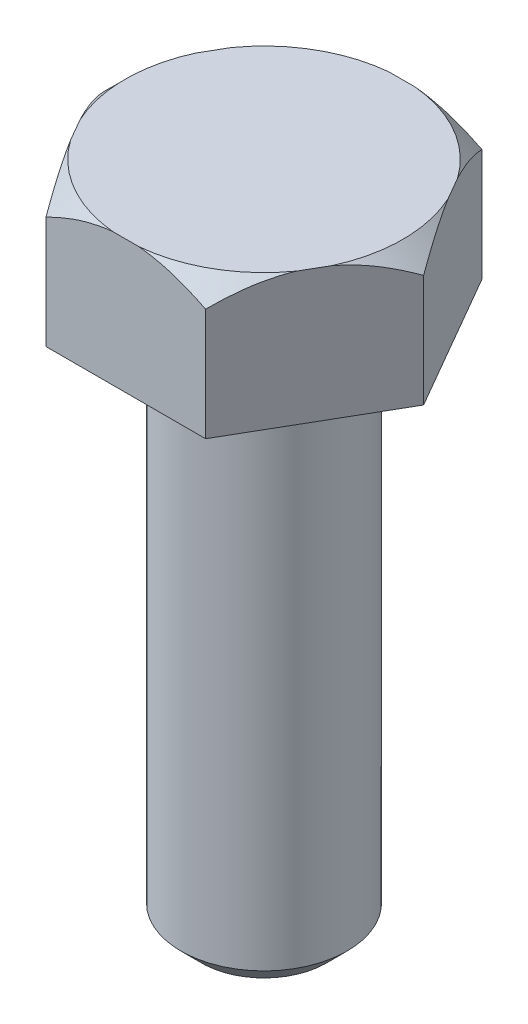
ISO-10303-21;
HEADER;
FILE_DESCRIPTION(('STEP AP214'),'2;1');
FILE_NAME('part.step','',(''),(''),'','','');
FILE_SCHEMA(('AUTOMOTIVE_DESIGN { 1 0 10303 214 1 1 1 1 }'));
ENDSEC;
DATA;
#1=APPLICATION_CONTEXT('core data for automotive mechanical design processes');
#2=APPLICATION_PROTOCOL_DEFINITION('international standard','automotive_design',2000,#1);
#3=PRODUCT_CONTEXT('',#1,'mechanical');
#4=PRODUCT('Part','Part','',(#3));
#5=PRODUCT_RELATED_PRODUCT_CATEGORY('part','',(#4));
#6=PRODUCT_DEFINITION_FORMATION('','',#4);
#7=PRODUCT_DEFINITION_CONTEXT('part definition',#1,'design');
#8=PRODUCT_DEFINITION('design','',#6,#7);
#9=PRODUCT_DEFINITION_SHAPE('','',#8);
#10=(LENGTH_UNIT() NAMED_UNIT(*) SI_UNIT(.MILLI.,.METRE.));
#11=(NAMED_UNIT(*) PLANE_ANGLE_UNIT() SI_UNIT($,.RADIAN.));
#12=(NAMED_UNIT(*) SI_UNIT($,.STERADIAN.) SOLID_ANGLE_UNIT());
#13=UNCERTAINTY_MEASURE_WITH_UNIT(LENGTH_MEASURE(1.E-05),#10,'distance_accuracy_value','');
#14=(GEOMETRIC_REPRESENTATION_CONTEXT(3) GLOBAL_UNCERTAINTY_ASSIGNED_CONTEXT((#13)) GLOBAL_UNIT_ASSIGNED_CONTEXT((#10,
#11,#12)) REPRESENTATION_CONTEXT('',''));
#15=CARTESIAN_POINT('',(0.,0.,0.));
#16=DIRECTION('',(0.,0.,1.));
#17=DIRECTION('',(1.,0.,0.));
#18=AXIS2_PLACEMENT_3D('',#15,#16,#17);
#19=CARTESIAN_POINT('',(-3.048,10.16,0.));
#20=DIRECTION('',(0.,1.,0.));
#21=DIRECTION('',(0.,0.,1.));
#22=AXIS2_PLACEMENT_3D('',#19,#20,#21);
#23=PLANE('',#22);
#24=CARTESIAN_POINT('',(0.,10.16,0.));
#25=DIRECTION('',(0.,-1.,0.));
#26=DIRECTION('',(0.,0.,-1.));
#27=AXIS2_PLACEMENT_3D('',#24,#25,#26);
#28=CIRCLE('',#27,1.5875);
#29=CARTESIAN_POINT('',(0.,10.16,-1.5875));
#30=VERTEX_POINT('',#29);
#31=EDGE_CURVE('E191',#30,#30,#28,.T.);
#32=ORIENTED_EDGE('',*,*,#31,.F.);
#33=EDGE_LOOP('',(#32));
#34=FACE_BOUND('',#33,.T.);
#35=DIRECTION('',(0.5,0.,-0.866025403784439));
#36=VECTOR('',#35,1.);
#37=CARTESIAN_POINT('',(-1.524,10.16,-2.63964543073497));
#38=LINE('',#37,#36);
#39=CARTESIAN_POINT('',(-3.048,10.16,0.));
#40=VERTEX_POINT('',#39);
#41=CARTESIAN_POINT('',(-1.524,10.16,-2.63964543073497));
#42=VERTEX_POINT('',#41);
#43=EDGE_CURVE('E131',#40,#42,#38,.T.);
#44=ORIENTED_EDGE('',*,*,#43,.T.);
#45=DIRECTION('',(1.,0.,0.));
#46=VECTOR('',#45,1.);
#47=CARTESIAN_POINT('',(1.524,10.16,-2.63964543073497));
#48=LINE('',#47,#46);
#49=CARTESIAN_POINT('',(1.524,10.16,-2.63964543073497));
#50=VERTEX_POINT('',#49);
#51=EDGE_CURVE('E122',#42,#50,#48,.T.);
#52=ORIENTED_EDGE('',*,*,#51,.T.);
#53=DIRECTION('',(0.5,0.,0.866025403784439));
#54=VECTOR('',#53,1.);
#55=CARTESIAN_POINT('',(3.048,10.16,0.));
#56=LINE('',#55,#54);
#57=CARTESIAN_POINT('',(3.048,10.16,0.));
#58=VERTEX_POINT('',#57);
#59=EDGE_CURVE('E130',#50,#58,#56,.T.);
#60=ORIENTED_EDGE('',*,*,#59,.T.);
#61=DIRECTION('',(-0.5,0.,0.866025403784439));
#62=VECTOR('',#61,1.);
#63=CARTESIAN_POINT('',(1.524,10.16,2.63964543073497));
#64=LINE('',#63,#62);
#65=CARTESIAN_POINT('',(1.524,10.16,2.63964543073497));
#66=VERTEX_POINT('',#65);
#67=EDGE_CURVE('E408',#58,#66,#64,.T.);
#68=ORIENTED_EDGE('',*,*,#67,.T.);
#69=DIRECTION('',(-1.,0.,0.));
#70=VECTOR('',#69,1.);
#71=CARTESIAN_POINT('',(-1.524,10.16,2.63964543073497));
#72=LINE('',#71,#70);
#73=CARTESIAN_POINT('',(-1.524,10.16,2.63964543073497));
#74=VERTEX_POINT('',#73);
#75=EDGE_CURVE('E406',#66,#74,#72,.T.);
#76=ORIENTED_EDGE('',*,*,#75,.T.);
#77=DIRECTION('',(-0.5,0.,-0.866025403784439));
#78=VECTOR('',#77,1.);
#79=CARTESIAN_POINT('',(-3.048,10.16,0.));
#80=LINE('',#79,#78);
#81=EDGE_CURVE('E144',#74,#40,#80,.T.);
#82=ORIENTED_EDGE('',*,*,#81,.T.);
#83=EDGE_LOOP('',(#44,#52,#60,#68,#76,#82));
#84=FACE_BOUND('',#83,.T.);
#85=ADVANCED_FACE('F34',(#34,#84),#23,.F.);
#86=CARTESIAN_POINT('',(0.,0.,0.));
#87=DIRECTION('',(0.,-1.,0.));
#88=DIRECTION('',(0.,0.,-1.));
#89=AXIS2_PLACEMENT_3D('',#86,#87,#88);
#90=CYLINDRICAL_SURFACE('',#89,1.5875);
#91=CARTESIAN_POINT('',(0.,0.396874999999999,0.));
#92=DIRECTION('',(0.,-1.,0.));
#93=DIRECTION('',(0.,0.,-1.));
#94=AXIS2_PLACEMENT_3D('',#91,#92,#93);
#95=CIRCLE('',#94,1.5875);
#96=CARTESIAN_POINT('',(0.,0.396874999999999,-1.5875));
#97=VERTEX_POINT('',#96);
#98=EDGE_CURVE('E193',#97,#97,#95,.T.);
#99=ORIENTED_EDGE('',*,*,#98,.F.);
#100=EDGE_LOOP('',(#99));
#101=FACE_BOUND('',#100,.T.);
#102=ORIENTED_EDGE('',*,*,#31,.T.);
#103=EDGE_LOOP('',(#102));
#104=FACE_BOUND('',#103,.T.);
#105=ADVANCED_FACE('F181',(#101,#104),#90,.T.);
#106=CARTESIAN_POINT('',(0.,0.396874999999999,0.));
#107=DIRECTION('',(0.,1.,0.));
#108=DIRECTION('',(0.,0.,1.));
#109=AXIS2_PLACEMENT_3D('',#106,#107,#108);
#110=CONICAL_SURFACE('',#109,1.5875,0.78539816339745);
#111=CARTESIAN_POINT('',(0.,0.,0.));
#112=DIRECTION('',(0.,-1.,0.));
#113=DIRECTION('',(0.,0.,-1.));
#114=AXIS2_PLACEMENT_3D('',#111,#112,#113);
#115=CIRCLE('',#114,1.190625);
#116=CARTESIAN_POINT('',(0.,0.,-1.190625));
#117=VERTEX_POINT('',#116);
#118=EDGE_CURVE('E197',#117,#117,#115,.T.);
#119=ORIENTED_EDGE('',*,*,#118,.F.);
#120=EDGE_LOOP('',(#119));
#121=FACE_BOUND('',#120,.T.);
#122=ORIENTED_EDGE('',*,*,#98,.T.);
#123=EDGE_LOOP('',(#122));
#124=FACE_BOUND('',#123,.T.);
#125=ADVANCED_FACE('F177',(#121,#124),#110,.T.);
#126=CARTESIAN_POINT('',(-1.190625,0.,0.));
#127=DIRECTION('',(0.,1.,0.));
#128=DIRECTION('',(0.,0.,1.));
#129=AXIS2_PLACEMENT_3D('',#126,#127,#128);
#130=PLANE('',#129);
#131=ORIENTED_EDGE('',*,*,#118,.T.);
#132=EDGE_LOOP('',(#131));
#133=FACE_BOUND('',#132,.T.);
#134=ADVANCED_FACE('F174',(#133),#130,.F.);
#135=CARTESIAN_POINT('',(-1.524,1.3975327675363,-2.63964543073497));
#136=DIRECTION('',(-0.866025403784439,0.,-0.5));
#137=DIRECTION('',(-0.5,0.,0.866025403784439));
#138=AXIS2_PLACEMENT_3D('',#135,#136,#137);
#139=PLANE('',#138);
#140=CARTESIAN_POINT('',(-4.11288664353432,10.8435993779656,1.84443777090293));
#141=CARTESIAN_POINT('',(-4.07678582740626,10.9021209194026,1.78190932317444));
#142=CARTESIAN_POINT('',(-4.04054164918159,10.9602899269393,1.71913256501072));
#143=CARTESIAN_POINT('',(-3.96771769626619,11.0757945337847,1.59299777855325));
#144=CARTESIAN_POINT('',(-3.93113789170358,11.1331300577135,1.52963969851987));
#145=CARTESIAN_POINT('',(-3.82066132939985,11.3039412367449,1.33828867956426));
#146=CARTESIAN_POINT('',(-3.74619407603881,11.4159494067831,1.20930761324282));
#147=CARTESIAN_POINT('',(-3.59317502716506,11.6374949520919,0.94427084606763));
#148=CARTESIAN_POINT('',(-3.51456722255849,11.7468797101761,0.808118134617601));
#149=CARTESIAN_POINT('',(-3.39455641306745,11.9044288300019,0.600253315121653));
#150=CARTESIAN_POINT('',(-3.35421954813982,11.9558378998242,0.530387815648951));
#151=CARTESIAN_POINT('',(-3.27272248072625,12.0559667510177,0.389230754220786));
#152=CARTESIAN_POINT('',(-3.23156238270255,12.1046868706842,0.317939373199215));
#153=CARTESIAN_POINT('',(-3.14719519820696,12.2000323111787,0.171811123161321));
#154=CARTESIAN_POINT('',(-3.10396275561702,12.2465684687686,0.0969303360602448));
#155=CARTESIAN_POINT('',(-3.01635996860491,12.3352138177515,-0.0548021419293754));
#156=CARTESIAN_POINT('',(-2.97198946278154,12.3773223768515,-0.131654112372982));
#157=CARTESIAN_POINT('',(-2.88225517921881,12.4557269039846,-0.287078450684421));
#158=CARTESIAN_POINT('',(-2.83689805560691,12.4920530198065,-0.365639293265417));
#159=CARTESIAN_POINT('',(-2.74493724949411,12.5577655240635,-0.524920081757766));
#160=CARTESIAN_POINT('',(-2.69833394902363,12.5871540127635,-0.605639365973049));
#161=CARTESIAN_POINT('',(-2.61324102682555,12.6325347284284,-0.753024630584625));
#162=CARTESIAN_POINT('',(-2.57495209164136,12.6500237553908,-0.819343011691345));
#163=CARTESIAN_POINT('',(-2.49779115091639,12.6787834768816,-0.952989681386816));
#164=CARTESIAN_POINT('',(-2.45891923092847,12.6900550748196,-1.02031782179364));
#165=CARTESIAN_POINT('',(-2.38089756061301,12.7058011115166,-1.15545531887141));
#166=CARTESIAN_POINT('',(-2.34174842648433,12.7102875891306,-1.22326360825461));
#167=CARTESIAN_POINT('',(-2.26340495118995,12.712255166541,-1.35895848790599));
#168=CARTESIAN_POINT('',(-2.22421060958001,12.7097361969007,-1.42684507894362));
#169=CARTESIAN_POINT('',(-2.1461896803201,12.6978483985597,-1.56198129247552));
#170=CARTESIAN_POINT('',(-2.10736239969831,12.6884974706097,-1.62923211523219));
#171=CARTESIAN_POINT('',(-2.03022149857727,12.6634458657462,-1.76284407531549));
#172=CARTESIAN_POINT('',(-1.99190800201554,12.6477436842384,-1.82920499797601));
#173=CARTESIAN_POINT('',(-1.91586591130841,12.6106384716489,-1.96091376259452));
#174=CARTESIAN_POINT('',(-1.87813938118311,12.5892187242104,-2.02625802956483));
#175=CARTESIAN_POINT('',(-1.80347838700056,12.5414934204444,-2.15557466483259));
#176=CARTESIAN_POINT('',(-1.76654388607405,12.5151880920958,-2.21954709698951));
#177=CARTESIAN_POINT('',(-1.68054671166346,12.4484188088564,-2.36849857237602));
#178=CARTESIAN_POINT('',(-1.63181840695243,12.4062389424071,-2.45289847190222));
#179=CARTESIAN_POINT('',(-1.53573732999577,12.3159803932736,-2.61931577883709));
#180=CARTESIAN_POINT('',(-1.48838530073285,12.2678985949876,-2.70133189936196));
#181=CARTESIAN_POINT('',(-1.39482537931209,12.1670593703652,-2.86338243681487));
#182=CARTESIAN_POINT('',(-1.34862006534442,12.1142924483695,-2.94341238818654));
#183=CARTESIAN_POINT('',(-1.25729466551731,12.0051863160205,-3.10159262070863));
#184=CARTESIAN_POINT('',(-1.21217439101574,11.9488477329114,-3.17974322859681));
#185=CARTESIAN_POINT('',(-1.12264370951622,11.8330812268348,-3.33481491779025));
#186=CARTESIAN_POINT('',(-1.07823755123089,11.7736402198207,-3.41172864010938));
#187=CARTESIAN_POINT('',(-0.990207339851307,11.652479989206,-3.56420143881985));
#188=CARTESIAN_POINT('',(-0.94658335243382,11.5907605756123,-3.63976040145569));
#189=CARTESIAN_POINT('',(-0.816795966696674,11.4030087920242,-3.86455874773396));
#190=CARTESIAN_POINT('',(-0.731617550326509,11.2742511881687,-4.01209209259535));
#191=CARTESIAN_POINT('',(-0.615697802164191,11.0936824781044,-4.21287098601307));
#192=CARTESIAN_POINT('',(-0.58413126456951,11.043954908037,-4.26754583294609));
#193=CARTESIAN_POINT('',(-0.521379413626723,10.9441052314947,-4.37623522704799));
#194=CARTESIAN_POINT('',(-0.490193037172694,10.8939857986208,-4.43025161557033));
#195=CARTESIAN_POINT('',(-0.459113356465683,10.8435993779656,-4.48408320163789));
#196=B_SPLINE_CURVE_WITH_KNOTS('',3,(#140,#141,#142,#143,#144,#145,#146,#147,#148,#149,#150,
#151,#152,#153,#154,#155,#156,#157,#158,#159,#160,#161,#162,#163,#164,#165,#166,#167,#168,#169,
#170,#171,#172,#173,#174,#175,#176,#177,#178,#179,#180,#181,#182,#183,#184,#185,#186,#187,#188,
#189,#190,#191,#192,#193,#194,#195),.UNSPECIFIED.,.F.,.F.,(4,2,2,2,2,2,2,2,2,2,2,2,2,2,2,2,2,2,
2,2,2,2,2,2,2,2,2,4),(0.,0.27881946553275,0.557663992439258,1.11664345937222,1.69099253991238,
1.97793713434816,2.26484554577308,2.55932247188747,2.85384139446958,3.14677059194029,
3.43961099533733,3.67503579126983,3.91042637031573,4.14539880327292,4.3803735652388,
4.61473485617055,4.84915169918358,5.08426155571407,5.31936044392315,5.63767189464671,
5.95615210903306,6.27529322345623,6.59437844571967,6.91493955731194,7.2355274606777,
7.87598755404172,8.1170834857588,8.35712587637016),.UNSPECIFIED.);
#197=CARTESIAN_POINT('',(-3.048,12.303125,0.));
#198=VERTEX_POINT('',#197);
#199=CARTESIAN_POINT('',(-2.40922313665156,12.7,-1.10639398201899));
#200=VERTEX_POINT('',#199);
#201=EDGE_CURVE('E202',#198,#200,#196,.T.);
#202=ORIENTED_EDGE('',*,*,#201,.T.);
#203=DIRECTION('',(-0.5,0.,0.866025403784439));
#204=VECTOR('',#203,1.);
#205=CARTESIAN_POINT('',(-1.524,12.7,-2.63964543073497));
#206=LINE('',#205,#204);
#207=CARTESIAN_POINT('',(-2.16277686334844,12.7,-1.53325144871598));
#208=VERTEX_POINT('',#207);
#209=EDGE_CURVE('E253',#208,#200,#206,.T.);
#210=ORIENTED_EDGE('',*,*,#209,.F.);
#211=CARTESIAN_POINT('',(-1.524,12.303125,-2.63964543073497));
#212=VERTEX_POINT('',#211);
#213=EDGE_CURVE('E138',#208,#212,#196,.T.);
#214=ORIENTED_EDGE('',*,*,#213,.T.);
#215=DIRECTION('',(0.,1.,0.));
#216=VECTOR('',#215,1.);
#217=CARTESIAN_POINT('',(-1.524,1.3975327675363,-2.63964543073497));
#218=LINE('',#217,#216);
#219=EDGE_CURVE('E125',#42,#212,#218,.T.);
#220=ORIENTED_EDGE('',*,*,#219,.F.);
#221=ORIENTED_EDGE('',*,*,#43,.F.);
#222=DIRECTION('',(0.,1.,0.));
#223=VECTOR('',#222,1.);
#224=CARTESIAN_POINT('',(-3.048,1.3975327675363,0.));
#225=LINE('',#224,#223);
#226=EDGE_CURVE('E139',#40,#198,#225,.T.);
#227=ORIENTED_EDGE('',*,*,#226,.T.);
#228=EDGE_LOOP('',(#202,#210,#214,#220,#221,#227));
#229=FACE_BOUND('',#228,.T.);
#230=ADVANCED_FACE('F134',(#229),#139,.T.);
#231=CARTESIAN_POINT('',(-3.048,1.3975327675363,0.));
#232=DIRECTION('',(-0.866025403784439,0.,0.5));
#233=DIRECTION('',(0.5,0.,0.866025403784439));
#234=AXIS2_PLACEMENT_3D('',#231,#232,#233);
#235=PLANE('',#234);
#236=CARTESIAN_POINT('',(-0.459113356465683,10.8435993779656,4.4840832016379));
#237=CARTESIAN_POINT('',(-0.495214172593737,10.9021209194026,4.4215547539094));
#238=CARTESIAN_POINT('',(-0.531458350818409,10.9602899269393,4.35877799574569));
#239=CARTESIAN_POINT('',(-0.604282303733805,11.0757945337847,4.23264320928822));
#240=CARTESIAN_POINT('',(-0.640862108296419,11.1331300577135,4.16928512925484));
#241=CARTESIAN_POINT('',(-0.751338670600148,11.3039412367449,3.97793411029923));
#242=CARTESIAN_POINT('',(-0.825805923961193,11.4159494067831,3.84895304397779));
#243=CARTESIAN_POINT('',(-0.978824972834937,11.6374949520919,3.5839162768026));
#244=CARTESIAN_POINT('',(-1.05743277744151,11.7468797101761,3.44776356535257));
#245=CARTESIAN_POINT('',(-1.17744358693255,11.9044288300019,3.23989874585663));
#246=CARTESIAN_POINT('',(-1.21778045186018,11.9558378998242,3.17003324638392));
#247=CARTESIAN_POINT('',(-1.29927751927375,12.0559667510177,3.02887618495576));
#248=CARTESIAN_POINT('',(-1.34043761729745,12.1046868706842,2.95758480393419));
#249=CARTESIAN_POINT('',(-1.42480480179304,12.2000323111787,2.81145655389629));
#250=CARTESIAN_POINT('',(-1.46803724438298,12.2465684687686,2.73657576679522));
#251=CARTESIAN_POINT('',(-1.55564003139509,12.3352138177515,2.5848432888056));
#252=CARTESIAN_POINT('',(-1.60001053721846,12.3773223768515,2.50799131836199));
#253=CARTESIAN_POINT('',(-1.68974482078119,12.4557269039846,2.35256698005055));
#254=CARTESIAN_POINT('',(-1.73510194439309,12.4920530198065,2.27400613746955));
#255=CARTESIAN_POINT('',(-1.82706275050589,12.5577655240635,2.11472534897721));
#256=CARTESIAN_POINT('',(-1.87366605097637,12.5871540127635,2.03400606476192));
#257=CARTESIAN_POINT('',(-1.95875897317445,12.6325347284284,1.88662080015035));
#258=CARTESIAN_POINT('',(-1.99704790835864,12.6500237553908,1.82030241904363));
#259=CARTESIAN_POINT('',(-2.07420884908361,12.6787834768816,1.68665574934816));
#260=CARTESIAN_POINT('',(-2.11308076907153,12.6900550748196,1.61932760894133));
#261=CARTESIAN_POINT('',(-2.19110243938699,12.7058011115166,1.48419011186357));
#262=CARTESIAN_POINT('',(-2.23025157351567,12.7102875891306,1.41638182248036));
#263=CARTESIAN_POINT('',(-2.30859504881005,12.712255166541,1.28068694282898));
#264=CARTESIAN_POINT('',(-2.34778939041999,12.7097361969007,1.21280035179135));
#265=CARTESIAN_POINT('',(-2.4258103196799,12.6978483985597,1.07766413825945));
#266=CARTESIAN_POINT('',(-2.46463760030169,12.6884974706097,1.01041331550278));
#267=CARTESIAN_POINT('',(-2.54177850142273,12.6634458657462,0.876801355419483));
#268=CARTESIAN_POINT('',(-2.58009199798446,12.6477436842384,0.810440432758961));
#269=CARTESIAN_POINT('',(-2.65613408869159,12.6106384716489,0.678731668140453));
#270=CARTESIAN_POINT('',(-2.69386061881689,12.5892187242104,0.613387401170142));
#271=CARTESIAN_POINT('',(-2.76852161299943,12.5414934204444,0.484070765902376));
#272=CARTESIAN_POINT('',(-2.80545611392595,12.5151880920958,0.420098333745457));
#273=CARTESIAN_POINT('',(-2.89145328833654,12.4484188088564,0.271146858358955));
#274=CARTESIAN_POINT('',(-2.94018159304757,12.4062389424071,0.186746958832748));
#275=CARTESIAN_POINT('',(-3.03626267000423,12.3159803932736,0.0203296518978808));
#276=CARTESIAN_POINT('',(-3.08361469926715,12.2678985949876,-0.0616864686269907));
#277=CARTESIAN_POINT('',(-3.17717462068791,12.1670593703652,-0.223737006079898));
#278=CARTESIAN_POINT('',(-3.22337993465557,12.1142924483695,-0.303766957451566));
#279=CARTESIAN_POINT('',(-3.31470533448268,12.0051863160205,-0.461947189973658));
#280=CARTESIAN_POINT('',(-3.35982560898425,11.9488477329114,-0.540097797861834));
#281=CARTESIAN_POINT('',(-3.44935629048378,11.8330812268348,-0.695169487055275));
#282=CARTESIAN_POINT('',(-3.4937624487691,11.7736402198207,-0.772083209374405));
#283=CARTESIAN_POINT('',(-3.58179266014869,11.652479989206,-0.924556008084875));
#284=CARTESIAN_POINT('',(-3.62541664756617,11.5907605756123,-1.00011497072071));
#285=CARTESIAN_POINT('',(-3.75520403330332,11.4030087920242,-1.22491331699899));
#286=CARTESIAN_POINT('',(-3.84038244967348,11.2742511881687,-1.37244666186037));
#287=CARTESIAN_POINT('',(-3.9563021978358,11.0936824781044,-1.57322555527809));
#288=CARTESIAN_POINT('',(-3.98786873543049,11.043954908037,-1.62790040221111));
#289=CARTESIAN_POINT('',(-4.05062058637328,10.9441052314947,-1.73658979631302));
#290=CARTESIAN_POINT('',(-4.08180696282731,10.8939857986208,-1.79060618483537));
#291=CARTESIAN_POINT('',(-4.11288664353432,10.8435993779656,-1.84443777090293));
#292=B_SPLINE_CURVE_WITH_KNOTS('',3,(#236,#237,#238,#239,#240,#241,#242,#243,#244,#245,#246,
#247,#248,#249,#250,#251,#252,#253,#254,#255,#256,#257,#258,#259,#260,#261,#262,#263,#264,#265,
#266,#267,#268,#269,#270,#271,#272,#273,#274,#275,#276,#277,#278,#279,#280,#281,#282,#283,#284,
#285,#286,#287,#288,#289,#290,#291),.UNSPECIFIED.,.F.,.F.,(4,2,2,2,2,2,2,2,2,2,2,2,2,2,2,2,2,2,
2,2,2,2,2,2,2,2,2,4),(0.,0.27881946553275,0.557663992439256,1.11664345937222,1.69099253991237,
1.97793713434816,2.26484554577308,2.55932247188747,2.85384139446958,3.14677059194028,
3.43961099533733,3.67503579126983,3.91042637031573,4.14539880327292,4.3803735652388,
4.61473485617055,4.84915169918358,5.08426155571406,5.31936044392315,5.63767189464671,
5.95615210903305,6.27529322345622,6.59437844571966,6.91493955731193,7.23552746067769,
7.8759875540417,8.1170834857588,8.35712587637016),.UNSPECIFIED.);
#293=CARTESIAN_POINT('',(-1.524,12.303125,2.63964543073497));
#294=VERTEX_POINT('',#293);
#295=CARTESIAN_POINT('',(-2.16277686334844,12.7,1.53325144871598));
#296=VERTEX_POINT('',#295);
#297=EDGE_CURVE('E207',#294,#296,#292,.T.);
#298=ORIENTED_EDGE('',*,*,#297,.T.);
#299=DIRECTION('',(0.5,0.,0.866025403784439));
#300=VECTOR('',#299,1.);
#301=CARTESIAN_POINT('',(-3.048,12.7,0.));
#302=LINE('',#301,#300);
#303=CARTESIAN_POINT('',(-2.40922313665156,12.7,1.10639398201898));
#304=VERTEX_POINT('',#303);
#305=EDGE_CURVE('E282',#304,#296,#302,.T.);
#306=ORIENTED_EDGE('',*,*,#305,.F.);
#307=EDGE_CURVE('E208',#304,#198,#292,.T.);
#308=ORIENTED_EDGE('',*,*,#307,.T.);
#309=ORIENTED_EDGE('',*,*,#226,.F.);
#310=ORIENTED_EDGE('',*,*,#81,.F.);
#311=DIRECTION('',(0.,1.,0.));
#312=VECTOR('',#311,1.);
#313=CARTESIAN_POINT('',(-1.524,1.3975327675363,2.63964543073497));
#314=LINE('',#313,#312);
#315=EDGE_CURVE('E289',#74,#294,#314,.T.);
#316=ORIENTED_EDGE('',*,*,#315,.T.);
#317=EDGE_LOOP('',(#298,#306,#308,#309,#310,#316));
#318=FACE_BOUND('',#317,.T.);
#319=ADVANCED_FACE('F219',(#318),#235,.T.);
#320=CARTESIAN_POINT('',(-1.524,1.3975327675363,2.63964543073497));
#321=DIRECTION('',(0.,0.,1.));
#322=DIRECTION('',(1.,0.,0.));
#323=AXIS2_PLACEMENT_3D('',#320,#321,#322);
#324=PLANE('',#323);
#325=CARTESIAN_POINT('',(3.36843777090293,11.0716272471737,2.63964543073497));
#326=CARTESIAN_POINT('',(3.29300533086438,11.1309904142921,2.63964543073497));
#327=CARTESIAN_POINT('',(3.21721116588583,11.1898998144176,2.63964543073497));
#328=CARTESIAN_POINT('',(3.06475975547845,11.3066161754144,2.63964543073497));
#329=CARTESIAN_POINT('',(2.98810237080206,11.3644229542481,2.63964543073497));
#330=CARTESIAN_POINT('',(2.83342142775568,11.4790070758794,2.63964543073497));
#331=CARTESIAN_POINT('',(2.75539293681663,11.5357777774649,2.63964543073497));
#332=CARTESIAN_POINT('',(2.59819285687469,11.6477095018479,2.63964543073497));
#333=CARTESIAN_POINT('',(2.51902132254628,11.7028706012577,2.63964543073497));
#334=CARTESIAN_POINT('',(2.35540072261572,11.8139153435705,2.63964543073497));
#335=CARTESIAN_POINT('',(2.27088420410221,11.8696999741638,2.63964543073497));
#336=CARTESIAN_POINT('',(2.10014323865491,11.978588185785,2.63964543073497));
#337=CARTESIAN_POINT('',(2.0139189340055,12.0316919888691,2.63964543073497));
#338=CARTESIAN_POINT('',(1.83964075821573,12.1344403340379,2.63964543073497));
#339=CARTESIAN_POINT('',(1.75159063932343,12.1840912038149,2.63964543073497));
#340=CARTESIAN_POINT('',(1.57323353816042,12.2791390165827,2.63964543073497));
#341=CARTESIAN_POINT('',(1.48292717325064,12.3245371074288,2.63964543073497));
#342=CARTESIAN_POINT('',(1.30923491291055,12.4055265018222,2.63964543073497));
#343=CARTESIAN_POINT('',(1.22609731337137,12.4416463913053,2.63964543073497));
#344=CARTESIAN_POINT('',(1.05765772606736,12.5085214573747,2.63964543073497));
#345=CARTESIAN_POINT('',(0.972355531859266,12.5392761200453,2.63964543073497));
#346=CARTESIAN_POINT('',(0.800615928832101,12.5939220040834,2.63964543073497));
#347=CARTESIAN_POINT('',(0.714202325615142,12.6178870271769,2.63964543073497));
#348=CARTESIAN_POINT('',(0.53962783796491,12.6582223488823,2.63964543073497));
#349=CARTESIAN_POINT('',(0.451467669424469,12.6745956947032,2.63964543073497));
#350=CARTESIAN_POINT('',(0.272286007984842,12.6989838300076,2.63964543073497));
#351=CARTESIAN_POINT('',(0.181241872709602,12.7068358665952,2.63964543073497));
#352=CARTESIAN_POINT('',(-0.00116784871263757,12.713053046394,2.63964543073497));
#353=CARTESIAN_POINT('',(-0.0925334051359861,12.7114190449236,2.63964543073497));
#354=CARTESIAN_POINT('',(-0.2748747122584,12.6987708057578,2.63964543073497));
#355=CARTESIAN_POINT('',(-0.365848480939838,12.6877285389543,2.63964543073497));
#356=CARTESIAN_POINT('',(-0.546317141902598,12.6570072878376,2.63964543073497));
#357=CARTESIAN_POINT('',(-0.635811630573998,12.6373259855137,2.63964543073497));
#358=CARTESIAN_POINT('',(-0.839929534758161,12.5833150058955,2.63964543073497));
#359=CARTESIAN_POINT('',(-0.953848430684294,12.5463445751224,2.63964543073497));
#360=CARTESIAN_POINT('',(-1.17793818323342,12.4624507503527,2.63964543073497));
#361=CARTESIAN_POINT('',(-1.28810675879306,12.415521420261,2.63964543073497));
#362=CARTESIAN_POINT('',(-1.50567750976445,12.3137777141947,2.63964543073497));
#363=CARTESIAN_POINT('',(-1.61305346512851,12.25890802436,2.63964543073497));
#364=CARTESIAN_POINT('',(-1.82462164483966,12.1434592657673,2.63964543073497));
#365=CARTESIAN_POINT('',(-1.92881459959967,12.082881520086,2.63964543073497));
#366=CARTESIAN_POINT('',(-2.14968617442244,11.9481665910634,2.63964543073497));
#367=CARTESIAN_POINT('',(-2.26594518996787,11.8733460140711,2.63964543073497));
#368=CARTESIAN_POINT('',(-2.4956556650067,11.7194908815111,2.63964543073497));
#369=CARTESIAN_POINT('',(-2.60910648475559,11.6404553784307,2.63964543073497));
#370=CARTESIAN_POINT('',(-2.83121308766027,11.4810303561209,2.63964543073497));
#371=CARTESIAN_POINT('',(-2.93991935744845,11.4007107742223,2.63964543073497));
#372=CARTESIAN_POINT('',(-3.15546241434351,11.2377565653697,2.63964543073497));
#373=CARTESIAN_POINT('',(-3.26230049829602,11.1551236570664,2.63964543073497));
#374=CARTESIAN_POINT('',(-3.36843777090293,11.0716272471737,2.63964543073497));
#375=B_SPLINE_CURVE_WITH_KNOTS('',3,(#325,#326,#327,#328,#329,#330,#331,#332,#333,#334,#335,
#336,#337,#338,#339,#340,#341,#342,#343,#344,#345,#346,#347,#348,#349,#350,#351,#352,#353,#354,
#355,#356,#357,#358,#359,#360,#361,#362,#363,#364,#365,#366,#367,#368,#369,#370,#371,#372,#373,
#374),.UNSPECIFIED.,.F.,.F.,(4,2,2,2,2,2,2,2,2,2,2,2,2,2,2,2,2,2,2,2,2,2,2,2,4),(0.,
0.287973001472166,0.575993141515308,0.865462127525053,1.15491731311935,1.45867727901225,
1.76241204269347,2.06557466941309,2.3686552331896,2.64043968682375,2.91225015942944,
3.1809815977582,3.4496050769024,3.72327344025735,3.99691712841025,4.27137891803137,
4.54591439581094,4.90458781329842,5.26347562496305,5.62499597601811,5.98643273504015,
6.40107016663567,6.81580120463352,7.22124646087129,7.62639809863121),.UNSPECIFIED.);
#376=CARTESIAN_POINT('',(1.524,12.303125,2.63964543073497));
#377=VERTEX_POINT('',#376);
#378=CARTESIAN_POINT('',(0.246446273303119,12.7,2.63964543073497));
#379=VERTEX_POINT('',#378);
#380=EDGE_CURVE('E213',#377,#379,#375,.T.);
#381=ORIENTED_EDGE('',*,*,#380,.T.);
#382=DIRECTION('',(1.,0.,0.));
#383=VECTOR('',#382,1.);
#384=CARTESIAN_POINT('',(-1.524,12.7,2.63964543073497));
#385=LINE('',#384,#383);
#386=CARTESIAN_POINT('',(-0.246446273303118,12.7,2.63964543073497));
#387=VERTEX_POINT('',#386);
#388=EDGE_CURVE('E279',#387,#379,#385,.T.);
#389=ORIENTED_EDGE('',*,*,#388,.F.);
#390=EDGE_CURVE('E214',#387,#294,#375,.T.);
#391=ORIENTED_EDGE('',*,*,#390,.T.);
#392=ORIENTED_EDGE('',*,*,#315,.F.);
#393=ORIENTED_EDGE('',*,*,#75,.F.);
#394=DIRECTION('',(0.,1.,0.));
#395=VECTOR('',#394,1.);
#396=CARTESIAN_POINT('',(1.524,1.3975327675363,2.63964543073497));
#397=LINE('',#396,#395);
#398=EDGE_CURVE('E287',#66,#377,#397,.T.);
#399=ORIENTED_EDGE('',*,*,#398,.T.);
#400=EDGE_LOOP('',(#381,#389,#391,#392,#393,#399));
#401=FACE_BOUND('',#400,.T.);
#402=ADVANCED_FACE('F222',(#401),#324,.T.);
#403=CARTESIAN_POINT('',(1.524,1.3975327675363,2.63964543073497));
#404=DIRECTION('',(0.866025403784439,0.,0.5));
#405=DIRECTION('',(0.5,0.,-0.866025403784439));
#406=AXIS2_PLACEMENT_3D('',#403,#404,#405);
#407=PLANE('',#406);
#408=CARTESIAN_POINT('',(4.11288664353432,10.8435993779656,-1.84443777090293));
#409=CARTESIAN_POINT('',(4.07678582740626,10.9021209194026,-1.78190932317444));
#410=CARTESIAN_POINT('',(4.04054164918159,10.9602899269393,-1.71913256501072));
#411=CARTESIAN_POINT('',(3.9677176962662,11.0757945337847,-1.59299777855325));
#412=CARTESIAN_POINT('',(3.93113789170358,11.1331300577135,-1.52963969851986));
#413=CARTESIAN_POINT('',(3.82066132939985,11.3039412367449,-1.33828867956425));
#414=CARTESIAN_POINT('',(3.74619407603881,11.4159494067831,-1.20930761324282));
#415=CARTESIAN_POINT('',(3.59317502716506,11.6374949520919,-0.944270846067629));
#416=CARTESIAN_POINT('',(3.51456722255849,11.7468797101761,-0.8081181346176));
#417=CARTESIAN_POINT('',(3.39455641306745,11.9044288300019,-0.600253315121653));
#418=CARTESIAN_POINT('',(3.35421954813982,11.9558378998242,-0.530387815648951));
#419=CARTESIAN_POINT('',(3.27272248072625,12.0559667510177,-0.389230754220786));
#420=CARTESIAN_POINT('',(3.23156238270255,12.1046868706842,-0.317939373199214));
#421=CARTESIAN_POINT('',(3.14719519820696,12.2000323111787,-0.171811123161321));
#422=CARTESIAN_POINT('',(3.10396275561702,12.2465684687686,-0.096930336060245));
#423=CARTESIAN_POINT('',(3.01635996860491,12.3352138177515,0.0548021419293748));
#424=CARTESIAN_POINT('',(2.97198946278154,12.3773223768515,0.131654112372982));
#425=CARTESIAN_POINT('',(2.88225517921881,12.4557269039846,0.287078450684421));
#426=CARTESIAN_POINT('',(2.83689805560691,12.4920530198065,0.365639293265418));
#427=CARTESIAN_POINT('',(2.74493724949411,12.5577655240635,0.524920081757766));
#428=CARTESIAN_POINT('',(2.69833394902363,12.5871540127635,0.60563936597305));
#429=CARTESIAN_POINT('',(2.61324102682555,12.6325347284284,0.753024630584626));
#430=CARTESIAN_POINT('',(2.57495209164136,12.6500237553908,0.819343011691347));
#431=CARTESIAN_POINT('',(2.49779115091639,12.6787834768816,0.952989681386818));
#432=CARTESIAN_POINT('',(2.45891923092847,12.6900550748196,1.02031782179364));
#433=CARTESIAN_POINT('',(2.38089756061301,12.7058011115166,1.15545531887141));
#434=CARTESIAN_POINT('',(2.34174842648433,12.7102875891306,1.22326360825461));
#435=CARTESIAN_POINT('',(2.26340495118995,12.712255166541,1.35895848790599));
#436=CARTESIAN_POINT('',(2.22421060958001,12.7097361969007,1.42684507894362));
#437=CARTESIAN_POINT('',(2.1461896803201,12.6978483985597,1.56198129247552));
#438=CARTESIAN_POINT('',(2.10736239969831,12.6884974706097,1.62923211523219));
#439=CARTESIAN_POINT('',(2.03022149857727,12.6634458657462,1.76284407531549));
#440=CARTESIAN_POINT('',(1.99190800201554,12.6477436842384,1.82920499797601));
#441=CARTESIAN_POINT('',(1.91586591130841,12.6106384716489,1.96091376259452));
#442=CARTESIAN_POINT('',(1.8781393811831,12.5892187242104,2.02625802956483));
#443=CARTESIAN_POINT('',(1.80347838700056,12.5414934204444,2.1555746648326));
#444=CARTESIAN_POINT('',(1.76654388607405,12.5151880920958,2.21954709698952));
#445=CARTESIAN_POINT('',(1.68054671166346,12.4484188088564,2.36849857237602));
#446=CARTESIAN_POINT('',(1.63181840695243,12.4062389424071,2.45289847190223));
#447=CARTESIAN_POINT('',(1.53573732999577,12.3159803932736,2.61931577883709));
#448=CARTESIAN_POINT('',(1.48838530073285,12.2678985949876,2.70133189936197));
#449=CARTESIAN_POINT('',(1.39482537931209,12.1670593703652,2.86338243681487));
#450=CARTESIAN_POINT('',(1.34862006534442,12.1142924483695,2.94341238818654));
#451=CARTESIAN_POINT('',(1.25729466551731,12.0051863160205,3.10159262070863));
#452=CARTESIAN_POINT('',(1.21217439101574,11.9488477329114,3.17974322859681));
#453=CARTESIAN_POINT('',(1.12264370951622,11.8330812268348,3.33481491779025));
#454=CARTESIAN_POINT('',(1.07823755123089,11.7736402198207,3.41172864010938));
#455=CARTESIAN_POINT('',(0.990207339851306,11.652479989206,3.56420143881985));
#456=CARTESIAN_POINT('',(0.946583352433818,11.5907605756123,3.63976040145569));
#457=CARTESIAN_POINT('',(0.816795966696671,11.4030087920242,3.86455874773397));
#458=CARTESIAN_POINT('',(0.731617550326507,11.2742511881687,4.01209209259535));
#459=CARTESIAN_POINT('',(0.61569780216419,11.0936824781044,4.21287098601307));
#460=CARTESIAN_POINT('',(0.584131264569508,11.043954908037,4.26754583294609));
#461=CARTESIAN_POINT('',(0.521379413626721,10.9441052314947,4.37623522704799));
#462=CARTESIAN_POINT('',(0.490193037172693,10.8939857986208,4.43025161557033));
#463=CARTESIAN_POINT('',(0.459113356465682,10.8435993779656,4.4840832016379));
#464=B_SPLINE_CURVE_WITH_KNOTS('',3,(#408,#409,#410,#411,#412,#413,#414,#415,#416,#417,#418,
#419,#420,#421,#422,#423,#424,#425,#426,#427,#428,#429,#430,#431,#432,#433,#434,#435,#436,#437,
#438,#439,#440,#441,#442,#443,#444,#445,#446,#447,#448,#449,#450,#451,#452,#453,#454,#455,#456,
#457,#458,#459,#460,#461,#462,#463),.UNSPECIFIED.,.F.,.F.,(4,2,2,2,2,2,2,2,2,2,2,2,2,2,2,2,2,2,
2,2,2,2,2,2,2,2,2,4),(0.,0.27881946553275,0.557663992439258,1.11664345937222,1.69099253991238,
1.97793713434816,2.26484554577308,2.55932247188747,2.85384139446958,3.14677059194029,
3.43961099533734,3.67503579126983,3.91042637031574,4.14539880327292,4.3803735652388,
4.61473485617055,4.84915169918359,5.08426155571407,5.31936044392316,5.63767189464672,
5.95615210903306,6.27529322345623,6.59437844571967,6.91493955731195,7.23552746067771,
7.87598755404172,8.1170834857588,8.35712587637016),.UNSPECIFIED.);
#465=CARTESIAN_POINT('',(3.048,12.303125,0.));
#466=VERTEX_POINT('',#465);
#467=CARTESIAN_POINT('',(2.40922313665155,12.7,1.10639398201899));
#468=VERTEX_POINT('',#467);
#469=EDGE_CURVE('E237',#466,#468,#464,.T.);
#470=ORIENTED_EDGE('',*,*,#469,.T.);
#471=DIRECTION('',(0.5,0.,-0.866025403784438));
#472=VECTOR('',#471,1.);
#473=CARTESIAN_POINT('',(1.524,12.7,2.63964543073497));
#474=LINE('',#473,#472);
#475=CARTESIAN_POINT('',(2.16277686334845,12.7,1.53325144871598));
#476=VERTEX_POINT('',#475);
#477=EDGE_CURVE('E274',#476,#468,#474,.T.);
#478=ORIENTED_EDGE('',*,*,#477,.F.);
#479=EDGE_CURVE('E233',#476,#377,#464,.T.);
#480=ORIENTED_EDGE('',*,*,#479,.T.);
#481=ORIENTED_EDGE('',*,*,#398,.F.);
#482=ORIENTED_EDGE('',*,*,#67,.F.);
#483=DIRECTION('',(0.,1.,0.));
#484=VECTOR('',#483,1.);
#485=CARTESIAN_POINT('',(3.048,1.3975327675363,0.));
#486=LINE('',#485,#484);
#487=EDGE_CURVE('E146',#58,#466,#486,.T.);
#488=ORIENTED_EDGE('',*,*,#487,.T.);
#489=EDGE_LOOP('',(#470,#478,#480,#481,#482,#488));
#490=FACE_BOUND('',#489,.T.);
#491=ADVANCED_FACE('F227',(#490),#407,.T.);
#492=CARTESIAN_POINT('',(3.048,1.3975327675363,0.));
#493=DIRECTION('',(0.866025403784439,0.,-0.5));
#494=DIRECTION('',(-0.5,0.,-0.866025403784439));
#495=AXIS2_PLACEMENT_3D('',#492,#493,#494);
#496=PLANE('',#495);
#497=CARTESIAN_POINT('',(0.459113356465683,10.8435993779656,-4.4840832016379));
#498=CARTESIAN_POINT('',(0.495214172593737,10.9021209194026,-4.4215547539094));
#499=CARTESIAN_POINT('',(0.531458350818409,10.9602899269393,-4.35877799574569));
#500=CARTESIAN_POINT('',(0.604282303733804,11.0757945337847,-4.23264320928822));
#501=CARTESIAN_POINT('',(0.640862108296418,11.1331300577135,-4.16928512925484));
#502=CARTESIAN_POINT('',(0.751338670600148,11.3039412367449,-3.97793411029923));
#503=CARTESIAN_POINT('',(0.825805923961193,11.4159494067831,-3.84895304397779));
#504=CARTESIAN_POINT('',(0.978824972834938,11.6374949520919,-3.5839162768026));
#505=CARTESIAN_POINT('',(1.05743277744151,11.7468797101761,-3.44776356535257));
#506=CARTESIAN_POINT('',(1.17744358693255,11.9044288300019,-3.23989874585663));
#507=CARTESIAN_POINT('',(1.21778045186018,11.9558378998242,-3.17003324638392));
#508=CARTESIAN_POINT('',(1.29927751927375,12.0559667510177,-3.02887618495576));
#509=CARTESIAN_POINT('',(1.34043761729745,12.1046868706842,-2.95758480393419));
#510=CARTESIAN_POINT('',(1.42480480179304,12.2000323111787,-2.81145655389629));
#511=CARTESIAN_POINT('',(1.46803724438298,12.2465684687686,-2.73657576679522));
#512=CARTESIAN_POINT('',(1.55564003139509,12.3352138177515,-2.5848432888056));
#513=CARTESIAN_POINT('',(1.60001053721846,12.3773223768515,-2.50799131836199));
#514=CARTESIAN_POINT('',(1.68974482078119,12.4557269039846,-2.35256698005055));
#515=CARTESIAN_POINT('',(1.73510194439309,12.4920530198065,-2.27400613746955));
#516=CARTESIAN_POINT('',(1.82706275050589,12.5577655240635,-2.11472534897721));
#517=CARTESIAN_POINT('',(1.87366605097637,12.5871540127635,-2.03400606476192));
#518=CARTESIAN_POINT('',(1.95875897317445,12.6325347284284,-1.88662080015035));
#519=CARTESIAN_POINT('',(1.99704790835864,12.6500237553908,-1.82030241904363));
#520=CARTESIAN_POINT('',(2.07420884908361,12.6787834768816,-1.68665574934815));
#521=CARTESIAN_POINT('',(2.11308076907153,12.6900550748196,-1.61932760894133));
#522=CARTESIAN_POINT('',(2.19110243938699,12.7058011115166,-1.48419011186357));
#523=CARTESIAN_POINT('',(2.23025157351567,12.7102875891306,-1.41638182248036));
#524=CARTESIAN_POINT('',(2.30859504881005,12.712255166541,-1.28068694282898));
#525=CARTESIAN_POINT('',(2.34778939041999,12.7097361969007,-1.21280035179135));
#526=CARTESIAN_POINT('',(2.4258103196799,12.6978483985597,-1.07766413825945));
#527=CARTESIAN_POINT('',(2.46463760030169,12.6884974706097,-1.01041331550278));
#528=CARTESIAN_POINT('',(2.54177850142273,12.6634458657462,-0.876801355419482));
#529=CARTESIAN_POINT('',(2.58009199798446,12.6477436842384,-0.81044043275896));
#530=CARTESIAN_POINT('',(2.65613408869159,12.6106384716489,-0.678731668140452));
#531=CARTESIAN_POINT('',(2.69386061881689,12.5892187242104,-0.613387401170141));
#532=CARTESIAN_POINT('',(2.76852161299944,12.5414934204444,-0.484070765902375));
#533=CARTESIAN_POINT('',(2.80545611392595,12.5151880920958,-0.420098333745456));
#534=CARTESIAN_POINT('',(2.89145328833654,12.4484188088564,-0.271146858358954));
#535=CARTESIAN_POINT('',(2.94018159304757,12.4062389424071,-0.186746958832746));
#536=CARTESIAN_POINT('',(3.03626267000423,12.3159803932736,-0.0203296518978795));
#537=CARTESIAN_POINT('',(3.08361469926715,12.2678985949876,0.061686468626992));
#538=CARTESIAN_POINT('',(3.17717462068791,12.1670593703652,0.2237370060799));
#539=CARTESIAN_POINT('',(3.22337993465558,12.1142924483695,0.303766957451567));
#540=CARTESIAN_POINT('',(3.31470533448268,12.0051863160205,0.46194718997366));
#541=CARTESIAN_POINT('',(3.35982560898426,11.9488477329114,0.540097797861837));
#542=CARTESIAN_POINT('',(3.44935629048378,11.8330812268348,0.695169487055278));
#543=CARTESIAN_POINT('',(3.4937624487691,11.7736402198207,0.772083209374408));
#544=CARTESIAN_POINT('',(3.58179266014869,11.652479989206,0.924556008084879));
#545=CARTESIAN_POINT('',(3.62541664756618,11.5907605756123,1.00011497072071));
#546=CARTESIAN_POINT('',(3.75520403330332,11.4030087920242,1.22491331699899));
#547=CARTESIAN_POINT('',(3.84038244967349,11.2742511881687,1.37244666186037));
#548=CARTESIAN_POINT('',(3.95630219783581,11.0936824781044,1.5732255552781));
#549=CARTESIAN_POINT('',(3.98786873543049,11.043954908037,1.62790040221112));
#550=CARTESIAN_POINT('',(4.05062058637328,10.9441052314947,1.73658979631302));
#551=CARTESIAN_POINT('',(4.08180696282731,10.8939857986208,1.79060618483537));
#552=CARTESIAN_POINT('',(4.11288664353432,10.8435993779656,1.84443777090293));
#553=B_SPLINE_CURVE_WITH_KNOTS('',3,(#497,#498,#499,#500,#501,#502,#503,#504,#505,#506,#507,
#508,#509,#510,#511,#512,#513,#514,#515,#516,#517,#518,#519,#520,#521,#522,#523,#524,#525,#526,
#527,#528,#529,#530,#531,#532,#533,#534,#535,#536,#537,#538,#539,#540,#541,#542,#543,#544,#545,
#546,#547,#548,#549,#550,#551,#552),.UNSPECIFIED.,.F.,.F.,(4,2,2,2,2,2,2,2,2,2,2,2,2,2,2,2,2,2,
2,2,2,2,2,2,2,2,2,4),(0.,0.278819465532749,0.557663992439256,1.11664345937222,1.69099253991237,
1.97793713434816,2.26484554577308,2.55932247188747,2.85384139446958,3.14677059194028,
3.43961099533733,3.67503579126983,3.91042637031573,4.14539880327292,4.3803735652388,
4.61473485617055,4.84915169918358,5.08426155571406,5.31936044392315,5.63767189464671,
5.95615210903305,6.27529322345622,6.59437844571966,6.91493955731194,7.2355274606777,
7.87598755404171,8.1170834857588,8.35712587637016),.UNSPECIFIED.);
#554=CARTESIAN_POINT('',(1.524,12.303125,-2.63964543073497));
#555=VERTEX_POINT('',#554);
#556=CARTESIAN_POINT('',(2.16277686334845,12.7,-1.53325144871598));
#557=VERTEX_POINT('',#556);
#558=EDGE_CURVE('E238',#555,#557,#553,.T.);
#559=ORIENTED_EDGE('',*,*,#558,.T.);
#560=DIRECTION('',(-0.5,0.,-0.866025403784439));
#561=VECTOR('',#560,1.);
#562=CARTESIAN_POINT('',(3.048,12.7,0.));
#563=LINE('',#562,#561);
#564=CARTESIAN_POINT('',(2.40922313665155,12.7,-1.10639398201899));
#565=VERTEX_POINT('',#564);
#566=EDGE_CURVE('E140',#565,#557,#563,.T.);
#567=ORIENTED_EDGE('',*,*,#566,.F.);
#568=EDGE_CURVE('E157',#565,#466,#553,.T.);
#569=ORIENTED_EDGE('',*,*,#568,.T.);
#570=ORIENTED_EDGE('',*,*,#487,.F.);
#571=ORIENTED_EDGE('',*,*,#59,.F.);
#572=DIRECTION('',(0.,1.,0.));
#573=VECTOR('',#572,1.);
#574=CARTESIAN_POINT('',(1.524,1.3975327675363,-2.63964543073497));
#575=LINE('',#574,#573);
#576=EDGE_CURVE('E56',#50,#555,#575,.T.);
#577=ORIENTED_EDGE('',*,*,#576,.T.);
#578=EDGE_LOOP('',(#559,#567,#569,#570,#571,#577));
#579=FACE_BOUND('',#578,.T.);
#580=ADVANCED_FACE('F171',(#579),#496,.T.);
#581=CARTESIAN_POINT('',(1.524,1.3975327675363,-2.63964543073497));
#582=DIRECTION('',(0.,0.,-1.));
#583=DIRECTION('',(-1.,0.,0.));
#584=AXIS2_PLACEMENT_3D('',#581,#582,#583);
#585=PLANE('',#584);
#586=CARTESIAN_POINT('',(-3.36843777090293,11.0716272471737,-2.63964543073497));
#587=CARTESIAN_POINT('',(-3.29300533086438,11.1309904142921,-2.63964543073497));
#588=CARTESIAN_POINT('',(-3.21721116588583,11.1898998144176,-2.63964543073497));
#589=CARTESIAN_POINT('',(-3.06475975547845,11.3066161754144,-2.63964543073497));
#590=CARTESIAN_POINT('',(-2.98810237080206,11.3644229542481,-2.63964543073497));
#591=CARTESIAN_POINT('',(-2.83342142775568,11.4790070758794,-2.63964543073497));
#592=CARTESIAN_POINT('',(-2.75539293681663,11.5357777774649,-2.63964543073497));
#593=CARTESIAN_POINT('',(-2.59819285687469,11.6477095018479,-2.63964543073497));
#594=CARTESIAN_POINT('',(-2.51902132254628,11.7028706012577,-2.63964543073497));
#595=CARTESIAN_POINT('',(-2.35540072261572,11.8139153435705,-2.63964543073497));
#596=CARTESIAN_POINT('',(-2.27088420410221,11.8696999741638,-2.63964543073497));
#597=CARTESIAN_POINT('',(-2.10014323865491,11.978588185785,-2.63964543073497));
#598=CARTESIAN_POINT('',(-2.0139189340055,12.0316919888691,-2.63964543073497));
#599=CARTESIAN_POINT('',(-1.83964075821573,12.1344403340379,-2.63964543073497));
#600=CARTESIAN_POINT('',(-1.75159063932343,12.1840912038149,-2.63964543073497));
#601=CARTESIAN_POINT('',(-1.57323353816042,12.2791390165827,-2.63964543073497));
#602=CARTESIAN_POINT('',(-1.48292717325064,12.3245371074288,-2.63964543073497));
#603=CARTESIAN_POINT('',(-1.30923491291056,12.4055265018222,-2.63964543073497));
#604=CARTESIAN_POINT('',(-1.22609731337137,12.4416463913053,-2.63964543073497));
#605=CARTESIAN_POINT('',(-1.05765772606736,12.5085214573747,-2.63964543073497));
#606=CARTESIAN_POINT('',(-0.972355531859267,12.5392761200453,-2.63964543073497));
#607=CARTESIAN_POINT('',(-0.800615928832102,12.5939220040834,-2.63964543073497));
#608=CARTESIAN_POINT('',(-0.714202325615143,12.6178870271769,-2.63964543073497));
#609=CARTESIAN_POINT('',(-0.539627837964911,12.6582223488823,-2.63964543073497));
#610=CARTESIAN_POINT('',(-0.451467669424471,12.6745956947032,-2.63964543073497));
#611=CARTESIAN_POINT('',(-0.272286007984844,12.6989838300076,-2.63964543073497));
#612=CARTESIAN_POINT('',(-0.181241872709604,12.7068358665952,-2.63964543073497));
#613=CARTESIAN_POINT('',(0.00116784871263616,12.713053046394,-2.63964543073497));
#614=CARTESIAN_POINT('',(0.0925334051359848,12.7114190449236,-2.63964543073497));
#615=CARTESIAN_POINT('',(0.274874712258398,12.6987708057578,-2.63964543073497));
#616=CARTESIAN_POINT('',(0.365848480939836,12.6877285389543,-2.63964543073497));
#617=CARTESIAN_POINT('',(0.546317141902596,12.6570072878376,-2.63964543073497));
#618=CARTESIAN_POINT('',(0.635811630573996,12.6373259855137,-2.63964543073497));
#619=CARTESIAN_POINT('',(0.839929534758159,12.5833150058955,-2.63964543073497));
#620=CARTESIAN_POINT('',(0.953848430684292,12.5463445751224,-2.63964543073497));
#621=CARTESIAN_POINT('',(1.17793818323341,12.4624507503527,-2.63964543073497));
#622=CARTESIAN_POINT('',(1.28810675879306,12.415521420261,-2.63964543073497));
#623=CARTESIAN_POINT('',(1.50567750976444,12.3137777141947,-2.63964543073497));
#624=CARTESIAN_POINT('',(1.61305346512851,12.25890802436,-2.63964543073497));
#625=CARTESIAN_POINT('',(1.82462164483966,12.1434592657673,-2.63964543073497));
#626=CARTESIAN_POINT('',(1.92881459959966,12.082881520086,-2.63964543073497));
#627=CARTESIAN_POINT('',(2.14968617442244,11.9481665910634,-2.63964543073497));
#628=CARTESIAN_POINT('',(2.26594518996787,11.8733460140711,-2.63964543073497));
#629=CARTESIAN_POINT('',(2.4956556650067,11.7194908815111,-2.63964543073497));
#630=CARTESIAN_POINT('',(2.60910648475559,11.6404553784307,-2.63964543073497));
#631=CARTESIAN_POINT('',(2.83121308766027,11.4810303561209,-2.63964543073497));
#632=CARTESIAN_POINT('',(2.93991935744845,11.4007107742223,-2.63964543073497));
#633=CARTESIAN_POINT('',(3.15546241434351,11.2377565653697,-2.63964543073497));
#634=CARTESIAN_POINT('',(3.26230049829603,11.1551236570664,-2.63964543073497));
#635=CARTESIAN_POINT('',(3.36843777090293,11.0716272471737,-2.63964543073497));
#636=B_SPLINE_CURVE_WITH_KNOTS('',3,(#586,#587,#588,#589,#590,#591,#592,#593,#594,#595,#596,
#597,#598,#599,#600,#601,#602,#603,#604,#605,#606,#607,#608,#609,#610,#611,#612,#613,#614,#615,
#616,#617,#618,#619,#620,#621,#622,#623,#624,#625,#626,#627,#628,#629,#630,#631,#632,#633,#634,
#635),.UNSPECIFIED.,.F.,.F.,(4,2,2,2,2,2,2,2,2,2,2,2,2,2,2,2,2,2,2,2,2,2,2,2,4),(0.,
0.287973001472166,0.575993141515309,0.865462127525054,1.15491731311935,1.45867727901226,
1.76241204269348,2.06557466941309,2.3686552331896,2.64043968682375,2.91225015942944,
3.1809815977582,3.4496050769024,3.72327344025735,3.99691712841025,4.27137891803137,
4.54591439581094,4.90458781329842,5.26347562496305,5.62499597601811,5.98643273504015,
6.40107016663567,6.81580120463353,7.22124646087129,7.62639809863121),.UNSPECIFIED.);
#637=CARTESIAN_POINT('',(-0.246446273303119,12.7,-2.63964543073497));
#638=VERTEX_POINT('',#637);
#639=EDGE_CURVE('E156',#212,#638,#636,.T.);
#640=ORIENTED_EDGE('',*,*,#639,.T.);
#641=DIRECTION('',(-1.,0.,0.));
#642=VECTOR('',#641,1.);
#643=CARTESIAN_POINT('',(1.524,12.7,-2.63964543073497));
#644=LINE('',#643,#642);
#645=CARTESIAN_POINT('',(0.246446273303113,12.7,-2.63964543073497));
#646=VERTEX_POINT('',#645);
#647=EDGE_CURVE('E50',#646,#638,#644,.T.);
#648=ORIENTED_EDGE('',*,*,#647,.F.);
#649=EDGE_CURVE('E150',#646,#555,#636,.T.);
#650=ORIENTED_EDGE('',*,*,#649,.T.);
#651=ORIENTED_EDGE('',*,*,#576,.F.);
#652=ORIENTED_EDGE('',*,*,#51,.F.);
#653=ORIENTED_EDGE('',*,*,#219,.T.);
#654=EDGE_LOOP('',(#640,#648,#650,#651,#652,#653));
#655=FACE_BOUND('',#654,.T.);
#656=ADVANCED_FACE('F124',(#655),#585,.T.);
#657=CARTESIAN_POINT('',(0.,12.7,0.));
#658=DIRECTION('',(0.,-1.,0.));
#659=DIRECTION('',(0.,0.,-1.));
#660=AXIS2_PLACEMENT_3D('',#657,#658,#659);
#661=CONICAL_SURFACE('',#660,2.651125,0.78539816339745);
#662=ORIENTED_EDGE('',*,*,#213,.F.);
#663=CARTESIAN_POINT('',(0.,12.7,0.));
#664=DIRECTION('',(0.,-1.,0.));
#665=DIRECTION('',(0.,0.,-1.));
#666=AXIS2_PLACEMENT_3D('',#663,#664,#665);
#667=CIRCLE('',#666,2.651125);
#668=EDGE_CURVE('E43',#208,#638,#667,.T.);
#669=ORIENTED_EDGE('',*,*,#668,.T.);
#670=ORIENTED_EDGE('',*,*,#639,.F.);
#671=EDGE_LOOP('',(#662,#669,#670));
#672=FACE_BOUND('',#671,.T.);
#673=ADVANCED_FACE('F170',(#672),#661,.T.);
#674=ORIENTED_EDGE('',*,*,#558,.F.);
#675=ORIENTED_EDGE('',*,*,#649,.F.);
#676=EDGE_CURVE('E12',#646,#557,#667,.T.);
#677=ORIENTED_EDGE('',*,*,#676,.T.);
#678=EDGE_LOOP('',(#674,#675,#677));
#679=FACE_BOUND('',#678,.T.);
#680=ADVANCED_FACE('F256',(#679),#661,.T.);
#681=ORIENTED_EDGE('',*,*,#469,.F.);
#682=ORIENTED_EDGE('',*,*,#568,.F.);
#683=EDGE_CURVE('E42',#565,#468,#667,.T.);
#684=ORIENTED_EDGE('',*,*,#683,.T.);
#685=EDGE_LOOP('',(#681,#682,#684));
#686=FACE_BOUND('',#685,.T.);
#687=ADVANCED_FACE('F257',(#686),#661,.T.);
#688=ORIENTED_EDGE('',*,*,#380,.F.);
#689=ORIENTED_EDGE('',*,*,#479,.F.);
#690=EDGE_CURVE('E278',#476,#379,#667,.T.);
#691=ORIENTED_EDGE('',*,*,#690,.T.);
#692=EDGE_LOOP('',(#688,#689,#691));
#693=FACE_BOUND('',#692,.T.);
#694=ADVANCED_FACE('F263',(#693),#661,.T.);
#695=ORIENTED_EDGE('',*,*,#297,.F.);
#696=ORIENTED_EDGE('',*,*,#390,.F.);
#697=EDGE_CURVE('E297',#387,#296,#667,.T.);
#698=ORIENTED_EDGE('',*,*,#697,.T.);
#699=EDGE_LOOP('',(#695,#696,#698));
#700=FACE_BOUND('',#699,.T.);
#701=ADVANCED_FACE('F268',(#700),#661,.T.);
#702=ORIENTED_EDGE('',*,*,#201,.F.);
#703=ORIENTED_EDGE('',*,*,#307,.F.);
#704=EDGE_CURVE('E195',#304,#200,#667,.T.);
#705=ORIENTED_EDGE('',*,*,#704,.T.);
#706=EDGE_LOOP('',(#702,#703,#705));
#707=FACE_BOUND('',#706,.T.);
#708=ADVANCED_FACE('F163',(#707),#661,.T.);
#709=CARTESIAN_POINT('',(0.,12.7,0.));
#710=DIRECTION('',(0.,-1.,0.));
#711=DIRECTION('',(0.,0.,-1.));
#712=AXIS2_PLACEMENT_3D('',#709,#710,#711);
#713=PLANE('',#712);
#714=ORIENTED_EDGE('',*,*,#209,.T.);
#715=ORIENTED_EDGE('',*,*,#704,.F.);
#716=ORIENTED_EDGE('',*,*,#305,.T.);
#717=ORIENTED_EDGE('',*,*,#697,.F.);
#718=ORIENTED_EDGE('',*,*,#388,.T.);
#719=ORIENTED_EDGE('',*,*,#690,.F.);
#720=ORIENTED_EDGE('',*,*,#477,.T.);
#721=ORIENTED_EDGE('',*,*,#683,.F.);
#722=ORIENTED_EDGE('',*,*,#566,.T.);
#723=ORIENTED_EDGE('',*,*,#676,.F.);
#724=ORIENTED_EDGE('',*,*,#647,.T.);
#725=ORIENTED_EDGE('',*,*,#668,.F.);
#726=EDGE_LOOP('',(#714,#715,#716,#717,#718,#719,#720,#721,#722,#723,#724,#725));
#727=FACE_BOUND('',#726,.T.);
#728=ADVANCED_FACE('F36',(#727),#713,.F.);
#729=CLOSED_SHELL('',(#85,#105,#125,#134,#230,#319,#402,#491,#580,#656,#673,#680,#687,#694,#701,
#708,#728));
#730=MANIFOLD_SOLID_BREP('B2',#729);
#731=ADVANCED_BREP_SHAPE_REPRESENTATION('',(#18,#730),#14);
#732=SHAPE_DEFINITION_REPRESENTATION(#9,#731);
ENDSEC;
END-ISO-10303-21;
